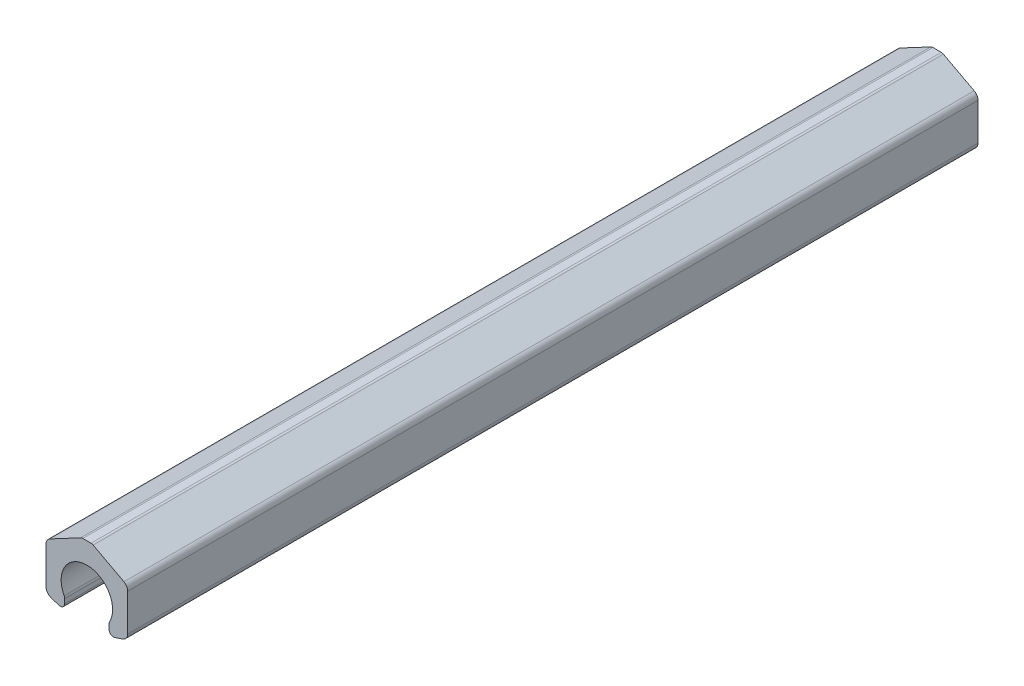
ISO-10303-21;
HEADER;
FILE_DESCRIPTION(('STEP AP214'),'2;1');
FILE_NAME('part.step','',(''),(''),'','','');
FILE_SCHEMA(('AUTOMOTIVE_DESIGN { 1 0 10303 214 1 1 1 1 }'));
ENDSEC;
DATA;
#1=APPLICATION_CONTEXT('core data for automotive mechanical design processes');
#2=APPLICATION_PROTOCOL_DEFINITION('international standard','automotive_design',2000,#1);
#3=PRODUCT_CONTEXT('',#1,'mechanical');
#4=PRODUCT('Part','Part','',(#3));
#5=PRODUCT_RELATED_PRODUCT_CATEGORY('part','',(#4));
#6=PRODUCT_DEFINITION_FORMATION('','',#4);
#7=PRODUCT_DEFINITION_CONTEXT('part definition',#1,'design');
#8=PRODUCT_DEFINITION('design','',#6,#7);
#9=PRODUCT_DEFINITION_SHAPE('','',#8);
#10=(LENGTH_UNIT() NAMED_UNIT(*) SI_UNIT(.MILLI.,.METRE.));
#11=(NAMED_UNIT(*) PLANE_ANGLE_UNIT() SI_UNIT($,.RADIAN.));
#12=(NAMED_UNIT(*) SI_UNIT($,.STERADIAN.) SOLID_ANGLE_UNIT());
#13=UNCERTAINTY_MEASURE_WITH_UNIT(LENGTH_MEASURE(1.E-05),#10,'distance_accuracy_value','');
#14=(GEOMETRIC_REPRESENTATION_CONTEXT(3) GLOBAL_UNCERTAINTY_ASSIGNED_CONTEXT((#13)) GLOBAL_UNIT_ASSIGNED_CONTEXT((#10,
#11,#12)) REPRESENTATION_CONTEXT('',''));
#15=CARTESIAN_POINT('',(0.,0.,0.));
#16=DIRECTION('',(0.,0.,1.));
#17=DIRECTION('',(1.,0.,0.));
#18=AXIS2_PLACEMENT_3D('',#15,#16,#17);
#19=CARTESIAN_POINT('',(2.9718,30.353,-609.6));
#20=DIRECTION('',(0.,0.,1.));
#21=DIRECTION('',(1.,0.,0.));
#22=AXIS2_PLACEMENT_3D('',#19,#20,#21);
#23=CYLINDRICAL_SURFACE('',#22,3.175);
#24=CARTESIAN_POINT('',(2.9718,30.353,0.));
#25=DIRECTION('',(0.,0.,1.));
#26=DIRECTION('',(1.,0.,0.));
#27=AXIS2_PLACEMENT_3D('',#24,#25,#26);
#28=CIRCLE('',#27,3.175);
#29=CARTESIAN_POINT('',(4.46106491990098,33.1570533158898,0.));
#30=VERTEX_POINT('',#29);
#31=CARTESIAN_POINT('',(2.9718,33.528,0.));
#32=VERTEX_POINT('',#31);
#33=EDGE_CURVE('E201',#30,#32,#28,.T.);
#34=ORIENTED_EDGE('',*,*,#33,.F.);
#35=DIRECTION('',(0.,0.,1.));
#36=VECTOR('',#35,1.);
#37=CARTESIAN_POINT('',(4.46106491990098,33.1570533158898,-609.6));
#38=LINE('',#37,#36);
#39=CARTESIAN_POINT('',(4.46106491990098,33.1570533158898,-609.6));
#40=VERTEX_POINT('',#39);
#41=EDGE_CURVE('E11',#40,#30,#38,.T.);
#42=ORIENTED_EDGE('',*,*,#41,.F.);
#43=CARTESIAN_POINT('',(2.9718,30.353,-609.6));
#44=DIRECTION('',(0.,0.,1.));
#45=DIRECTION('',(1.,0.,0.));
#46=AXIS2_PLACEMENT_3D('',#43,#44,#45);
#47=CIRCLE('',#46,3.175);
#48=CARTESIAN_POINT('',(2.9718,33.528,-609.6));
#49=VERTEX_POINT('',#48);
#50=EDGE_CURVE('E257',#40,#49,#47,.T.);
#51=ORIENTED_EDGE('',*,*,#50,.T.);
#52=DIRECTION('',(0.,0.,1.));
#53=VECTOR('',#52,1.);
#54=CARTESIAN_POINT('',(2.9718,33.528,-609.6));
#55=LINE('',#54,#53);
#56=EDGE_CURVE('E35',#49,#32,#55,.T.);
#57=ORIENTED_EDGE('',*,*,#56,.T.);
#58=EDGE_LOOP('',(#34,#42,#51,#57));
#59=FACE_BOUND('',#58,.T.);
#60=ADVANCED_FACE('F32',(#59),#23,.T.);
#61=CARTESIAN_POINT('',(26.5612662299192,21.419382585005,-609.6));
#62=DIRECTION('',(0.469059817291645,0.883166398705435,0.));
#63=DIRECTION('',(-0.883166398705436,0.469059817291645,0.));
#64=AXIS2_PLACEMENT_3D('',#61,#62,#63);
#65=PLANE('',#64);
#66=DIRECTION('',(-0.883166398705435,0.469059817291645,0.));
#67=VECTOR('',#66,1.);
#68=CARTESIAN_POINT('',(26.5612662299192,21.419382585005,0.));
#69=LINE('',#68,#67);
#70=CARTESIAN_POINT('',(26.5612662299192,21.419382585005,0.));
#71=VERTEX_POINT('',#70);
#72=EDGE_CURVE('E255',#71,#30,#69,.T.);
#73=ORIENTED_EDGE('',*,*,#72,.F.);
#74=DIRECTION('',(0.,0.,1.));
#75=VECTOR('',#74,1.);
#76=CARTESIAN_POINT('',(26.5612662299192,21.419382585005,-609.6));
#77=LINE('',#76,#75);
#78=CARTESIAN_POINT('',(26.5612662299192,21.419382585005,-609.6));
#79=VERTEX_POINT('',#78);
#80=EDGE_CURVE('E41',#79,#71,#77,.T.);
#81=ORIENTED_EDGE('',*,*,#80,.F.);
#82=DIRECTION('',(-0.883166398705435,0.469059817291645,0.));
#83=VECTOR('',#82,1.);
#84=CARTESIAN_POINT('',(26.5612662299192,21.419382585005,-609.6));
#85=LINE('',#84,#83);
#86=EDGE_CURVE('E191',#79,#40,#85,.T.);
#87=ORIENTED_EDGE('',*,*,#86,.T.);
#88=ORIENTED_EDGE('',*,*,#41,.T.);
#89=EDGE_LOOP('',(#73,#81,#87,#88));
#90=FACE_BOUND('',#89,.T.);
#91=ADVANCED_FACE('F293',(#90),#65,.T.);
#92=CARTESIAN_POINT('',(24.1427,16.8656,-609.6));
#93=DIRECTION('',(0.,0.,1.));
#94=DIRECTION('',(1.,0.,0.));
#95=AXIS2_PLACEMENT_3D('',#92,#93,#94);
#96=CYLINDRICAL_SURFACE('',#95,5.1562);
#97=CARTESIAN_POINT('',(24.1427,16.8656,0.));
#98=DIRECTION('',(0.,0.,1.));
#99=DIRECTION('',(1.,0.,0.));
#100=AXIS2_PLACEMENT_3D('',#97,#98,#99);
#101=CIRCLE('',#100,5.1562);
#102=CARTESIAN_POINT('',(29.2989,16.8656,0.));
#103=VERTEX_POINT('',#102);
#104=EDGE_CURVE('E178',#103,#71,#101,.T.);
#105=ORIENTED_EDGE('',*,*,#104,.F.);
#106=DIRECTION('',(0.,0.,1.));
#107=VECTOR('',#106,1.);
#108=CARTESIAN_POINT('',(29.2989,16.8656,-609.6));
#109=LINE('',#108,#107);
#110=CARTESIAN_POINT('',(29.2989,16.8656,-609.6));
#111=VERTEX_POINT('',#110);
#112=EDGE_CURVE('E173',#111,#103,#109,.T.);
#113=ORIENTED_EDGE('',*,*,#112,.F.);
#114=CARTESIAN_POINT('',(24.1427,16.8656,-609.6));
#115=DIRECTION('',(0.,0.,1.));
#116=DIRECTION('',(1.,0.,0.));
#117=AXIS2_PLACEMENT_3D('',#114,#115,#116);
#118=CIRCLE('',#117,5.1562);
#119=EDGE_CURVE('E176',#111,#79,#118,.T.);
#120=ORIENTED_EDGE('',*,*,#119,.T.);
#121=ORIENTED_EDGE('',*,*,#80,.T.);
#122=EDGE_LOOP('',(#105,#113,#120,#121));
#123=FACE_BOUND('',#122,.T.);
#124=ADVANCED_FACE('F175',(#123),#96,.T.);
#125=CARTESIAN_POINT('',(29.2989,-9.652,-609.6));
#126=DIRECTION('',(1.,0.,0.));
#127=DIRECTION('',(0.,1.,0.));
#128=AXIS2_PLACEMENT_3D('',#125,#126,#127);
#129=PLANE('',#128);
#130=DIRECTION('',(0.,1.,0.));
#131=VECTOR('',#130,1.);
#132=CARTESIAN_POINT('',(29.2989,-9.652,0.));
#133=LINE('',#132,#131);
#134=CARTESIAN_POINT('',(29.2989,-9.652,0.));
#135=VERTEX_POINT('',#134);
#136=EDGE_CURVE('E252',#135,#103,#133,.T.);
#137=ORIENTED_EDGE('',*,*,#136,.F.);
#138=DIRECTION('',(0.,0.,1.));
#139=VECTOR('',#138,1.);
#140=CARTESIAN_POINT('',(29.2989,-9.652,-609.6));
#141=LINE('',#140,#139);
#142=CARTESIAN_POINT('',(29.2989,-9.652,-609.6));
#143=VERTEX_POINT('',#142);
#144=EDGE_CURVE('E183',#143,#135,#141,.T.);
#145=ORIENTED_EDGE('',*,*,#144,.F.);
#146=DIRECTION('',(0.,1.,0.));
#147=VECTOR('',#146,1.);
#148=CARTESIAN_POINT('',(29.2989,-9.652,-609.6));
#149=LINE('',#148,#147);
#150=EDGE_CURVE('E189',#143,#111,#149,.T.);
#151=ORIENTED_EDGE('',*,*,#150,.T.);
#152=ORIENTED_EDGE('',*,*,#112,.T.);
#153=EDGE_LOOP('',(#137,#145,#151,#152));
#154=FACE_BOUND('',#153,.T.);
#155=ADVANCED_FACE('F193',(#154),#129,.T.);
#156=CARTESIAN_POINT('',(24.1427,-9.652,-609.6));
#157=DIRECTION('',(0.,0.,1.));
#158=DIRECTION('',(1.,0.,0.));
#159=AXIS2_PLACEMENT_3D('',#156,#157,#158);
#160=CYLINDRICAL_SURFACE('',#159,5.1562);
#161=CARTESIAN_POINT('',(24.1427,-9.652,0.));
#162=DIRECTION('',(0.,0.,1.));
#163=DIRECTION('',(1.,0.,0.));
#164=AXIS2_PLACEMENT_3D('',#161,#162,#163);
#165=CIRCLE('',#164,5.1562);
#166=CARTESIAN_POINT('',(25.9998307692308,-14.462141759447,0.));
#167=VERTEX_POINT('',#166);
#168=EDGE_CURVE('E249',#167,#135,#165,.T.);
#169=ORIENTED_EDGE('',*,*,#168,.F.);
#170=DIRECTION('',(0.,0.,1.));
#171=VECTOR('',#170,1.);
#172=CARTESIAN_POINT('',(25.9998307692308,-14.462141759447,-609.6));
#173=LINE('',#172,#171);
#174=CARTESIAN_POINT('',(25.9998307692308,-14.462141759447,-609.6));
#175=VERTEX_POINT('',#174);
#176=EDGE_CURVE('E261',#175,#167,#173,.T.);
#177=ORIENTED_EDGE('',*,*,#176,.F.);
#178=CARTESIAN_POINT('',(24.1427,-9.652,-609.6));
#179=DIRECTION('',(0.,0.,1.));
#180=DIRECTION('',(1.,0.,0.));
#181=AXIS2_PLACEMENT_3D('',#178,#179,#180);
#182=CIRCLE('',#181,5.1562);
#183=EDGE_CURVE('E194',#175,#143,#182,.T.);
#184=ORIENTED_EDGE('',*,*,#183,.T.);
#185=ORIENTED_EDGE('',*,*,#144,.T.);
#186=EDGE_LOOP('',(#169,#177,#184,#185));
#187=FACE_BOUND('',#186,.T.);
#188=ADVANCED_FACE('F306',(#187),#160,.T.);
#189=CARTESIAN_POINT('',(0.,52.8798428728116,-609.6));
#190=DIRECTION('',(0.,0.,1.));
#191=DIRECTION('',(1.,0.,0.));
#192=AXIS2_PLACEMENT_3D('',#189,#190,#191);
#193=CYLINDRICAL_SURFACE('',#192,72.1868);
#194=CARTESIAN_POINT('',(0.,52.8798428728116,0.));
#195=DIRECTION('',(0.,0.,1.));
#196=DIRECTION('',(1.,0.,0.));
#197=AXIS2_PLACEMENT_3D('',#194,#195,#196);
#198=CIRCLE('',#197,72.1868);
#199=CARTESIAN_POINT('',(19.9264262053735,-16.5022270943045,0.));
#200=VERTEX_POINT('',#199);
#201=EDGE_CURVE('E246',#200,#167,#198,.T.);
#202=ORIENTED_EDGE('',*,*,#201,.F.);
#203=DIRECTION('',(0.,0.,1.));
#204=VECTOR('',#203,1.);
#205=CARTESIAN_POINT('',(19.9264262053735,-16.5022270943045,-609.6));
#206=LINE('',#205,#204);
#207=CARTESIAN_POINT('',(19.9264262053735,-16.5022270943045,-609.6));
#208=VERTEX_POINT('',#207);
#209=EDGE_CURVE('E263',#208,#200,#206,.T.);
#210=ORIENTED_EDGE('',*,*,#209,.F.);
#211=CARTESIAN_POINT('',(0.,52.8798428728116,-609.6));
#212=DIRECTION('',(0.,0.,1.));
#213=DIRECTION('',(1.,0.,0.));
#214=AXIS2_PLACEMENT_3D('',#211,#212,#213);
#215=CIRCLE('',#214,72.1868);
#216=EDGE_CURVE('E196',#208,#175,#215,.T.);
#217=ORIENTED_EDGE('',*,*,#216,.T.);
#218=ORIENTED_EDGE('',*,*,#176,.T.);
#219=EDGE_LOOP('',(#202,#210,#217,#218));
#220=FACE_BOUND('',#219,.T.);
#221=ADVANCED_FACE('F309',(#220),#193,.T.);
#222=CARTESIAN_POINT('',(19.05,-13.4505878452231,-609.6));
#223=DIRECTION('',(0.,0.,1.));
#224=DIRECTION('',(1.,0.,0.));
#225=AXIS2_PLACEMENT_3D('',#222,#223,#224);
#226=CYLINDRICAL_SURFACE('',#225,3.175);
#227=CARTESIAN_POINT('',(19.05,-13.4505878452231,0.));
#228=DIRECTION('',(0.,0.,1.));
#229=DIRECTION('',(1.,0.,0.));
#230=AXIS2_PLACEMENT_3D('',#227,#228,#229);
#231=CIRCLE('',#230,3.175);
#232=CARTESIAN_POINT('',(15.875,-13.4505878452231,0.));
#233=VERTEX_POINT('',#232);
#234=EDGE_CURVE('E243',#233,#200,#231,.T.);
#235=ORIENTED_EDGE('',*,*,#234,.F.);
#236=DIRECTION('',(0.,0.,1.));
#237=VECTOR('',#236,1.);
#238=CARTESIAN_POINT('',(15.875,-13.4505878452231,-609.6));
#239=LINE('',#238,#237);
#240=CARTESIAN_POINT('',(15.875,-13.4505878452231,-609.6));
#241=VERTEX_POINT('',#240);
#242=EDGE_CURVE('E265',#241,#233,#239,.T.);
#243=ORIENTED_EDGE('',*,*,#242,.F.);
#244=CARTESIAN_POINT('',(19.05,-13.4505878452231,-609.6));
#245=DIRECTION('',(0.,0.,1.));
#246=DIRECTION('',(1.,0.,0.));
#247=AXIS2_PLACEMENT_3D('',#244,#245,#246);
#248=CIRCLE('',#247,3.175);
#249=EDGE_CURVE('E548',#241,#208,#248,.T.);
#250=ORIENTED_EDGE('',*,*,#249,.T.);
#251=ORIENTED_EDGE('',*,*,#209,.T.);
#252=EDGE_LOOP('',(#235,#243,#250,#251));
#253=FACE_BOUND('',#252,.T.);
#254=ADVANCED_FACE('F313',(#253),#226,.T.);
#255=CARTESIAN_POINT('',(15.875,-10.2407133350172,-609.6));
#256=DIRECTION('',(-1.,0.,0.));
#257=DIRECTION('',(0.,-1.,0.));
#258=AXIS2_PLACEMENT_3D('',#255,#256,#257);
#259=PLANE('',#258);
#260=DIRECTION('',(0.,-1.,0.));
#261=VECTOR('',#260,1.);
#262=CARTESIAN_POINT('',(15.875,-10.2407133350172,0.));
#263=LINE('',#262,#261);
#264=CARTESIAN_POINT('',(15.875,-10.2407133350172,0.));
#265=VERTEX_POINT('',#264);
#266=EDGE_CURVE('E240',#265,#233,#263,.T.);
#267=ORIENTED_EDGE('',*,*,#266,.F.);
#268=DIRECTION('',(0.,0.,1.));
#269=VECTOR('',#268,1.);
#270=CARTESIAN_POINT('',(15.875,-10.2407133350172,-609.6));
#271=LINE('',#270,#269);
#272=CARTESIAN_POINT('',(15.875,-10.2407133350172,-609.6));
#273=VERTEX_POINT('',#272);
#274=EDGE_CURVE('E267',#273,#265,#271,.T.);
#275=ORIENTED_EDGE('',*,*,#274,.F.);
#276=DIRECTION('',(0.,-1.,0.));
#277=VECTOR('',#276,1.);
#278=CARTESIAN_POINT('',(15.875,-10.2407133350172,-609.6));
#279=LINE('',#278,#277);
#280=EDGE_CURVE('E541',#273,#241,#279,.T.);
#281=ORIENTED_EDGE('',*,*,#280,.T.);
#282=ORIENTED_EDGE('',*,*,#242,.T.);
#283=EDGE_LOOP('',(#267,#275,#281,#282));
#284=FACE_BOUND('',#283,.T.);
#285=ADVANCED_FACE('F317',(#284),#259,.T.);
#286=CARTESIAN_POINT('',(19.05,-10.2407133350172,-609.6));
#287=DIRECTION('',(0.,0.,1.));
#288=DIRECTION('',(1.,0.,0.));
#289=AXIS2_PLACEMENT_3D('',#286,#287,#288);
#290=CYLINDRICAL_SURFACE('',#289,3.175);
#291=CARTESIAN_POINT('',(19.05,-10.2407133350172,0.));
#292=DIRECTION('',(0.,0.,1.));
#293=DIRECTION('',(1.,0.,0.));
#294=AXIS2_PLACEMENT_3D('',#291,#292,#293);
#295=CIRCLE('',#294,3.175);
#296=CARTESIAN_POINT('',(16.2534644744568,-8.73737902277162,0.));
#297=VERTEX_POINT('',#296);
#298=EDGE_CURVE('E237',#297,#265,#295,.T.);
#299=ORIENTED_EDGE('',*,*,#298,.F.);
#300=DIRECTION('',(0.,0.,1.));
#301=VECTOR('',#300,1.);
#302=CARTESIAN_POINT('',(16.2534644744568,-8.73737902277162,-609.6));
#303=LINE('',#302,#301);
#304=CARTESIAN_POINT('',(16.2534644744568,-8.73737902277162,-609.6));
#305=VERTEX_POINT('',#304);
#306=EDGE_CURVE('E269',#305,#297,#303,.T.);
#307=ORIENTED_EDGE('',*,*,#306,.F.);
#308=CARTESIAN_POINT('',(19.05,-10.2407133350172,-609.6));
#309=DIRECTION('',(0.,0.,1.));
#310=DIRECTION('',(1.,0.,0.));
#311=AXIS2_PLACEMENT_3D('',#308,#309,#310);
#312=CIRCLE('',#311,3.175);
#313=EDGE_CURVE('E537',#305,#273,#312,.T.);
#314=ORIENTED_EDGE('',*,*,#313,.T.);
#315=ORIENTED_EDGE('',*,*,#274,.T.);
#316=EDGE_LOOP('',(#299,#307,#314,#315));
#317=FACE_BOUND('',#316,.T.);
#318=ADVANCED_FACE('F321',(#317),#290,.T.);
#319=CARTESIAN_POINT('',(0.,0.,-609.6));
#320=DIRECTION('',(0.,0.,1.));
#321=DIRECTION('',(1.,0.,0.));
#322=AXIS2_PLACEMENT_3D('',#319,#320,#321);
#323=CYLINDRICAL_SURFACE('',#322,18.4531);
#324=CARTESIAN_POINT('',(0.,0.,0.));
#325=DIRECTION('',(0.,0.,-1.));
#326=DIRECTION('',(-1.,0.,0.));
#327=AXIS2_PLACEMENT_3D('',#324,#325,#326);
#328=CIRCLE('',#327,18.4531);
#329=CARTESIAN_POINT('',(-16.2534644744568,-8.73737902277161,0.));
#330=VERTEX_POINT('',#329);
#331=EDGE_CURVE('E234',#330,#297,#328,.T.);
#332=ORIENTED_EDGE('',*,*,#331,.F.);
#333=DIRECTION('',(0.,0.,1.));
#334=VECTOR('',#333,1.);
#335=CARTESIAN_POINT('',(-16.2534644744568,-8.73737902277161,-609.6));
#336=LINE('',#335,#334);
#337=CARTESIAN_POINT('',(-16.2534644744568,-8.73737902277161,-609.6));
#338=VERTEX_POINT('',#337);
#339=EDGE_CURVE('E271',#338,#330,#336,.T.);
#340=ORIENTED_EDGE('',*,*,#339,.F.);
#341=CARTESIAN_POINT('',(0.,0.,-609.6));
#342=DIRECTION('',(0.,0.,-1.));
#343=DIRECTION('',(-1.,0.,0.));
#344=AXIS2_PLACEMENT_3D('',#341,#342,#343);
#345=CIRCLE('',#344,18.4531);
#346=EDGE_CURVE('E553',#338,#305,#345,.T.);
#347=ORIENTED_EDGE('',*,*,#346,.T.);
#348=ORIENTED_EDGE('',*,*,#306,.T.);
#349=EDGE_LOOP('',(#332,#340,#347,#348));
#350=FACE_BOUND('',#349,.T.);
#351=ADVANCED_FACE('F325',(#350),#323,.F.);
#352=CARTESIAN_POINT('',(-19.05,-10.2407133350172,-609.6));
#353=DIRECTION('',(0.,0.,1.));
#354=DIRECTION('',(1.,0.,0.));
#355=AXIS2_PLACEMENT_3D('',#352,#353,#354);
#356=CYLINDRICAL_SURFACE('',#355,3.175);
#357=CARTESIAN_POINT('',(-19.05,-10.2407133350172,0.));
#358=DIRECTION('',(0.,0.,1.));
#359=DIRECTION('',(1.,0.,0.));
#360=AXIS2_PLACEMENT_3D('',#357,#358,#359);
#361=CIRCLE('',#360,3.175);
#362=CARTESIAN_POINT('',(-15.875,-10.2407133350172,0.));
#363=VERTEX_POINT('',#362);
#364=EDGE_CURVE('E231',#363,#330,#361,.T.);
#365=ORIENTED_EDGE('',*,*,#364,.F.);
#366=DIRECTION('',(0.,0.,1.));
#367=VECTOR('',#366,1.);
#368=CARTESIAN_POINT('',(-15.875,-10.2407133350172,-609.6));
#369=LINE('',#368,#367);
#370=CARTESIAN_POINT('',(-15.875,-10.2407133350172,-609.6));
#371=VERTEX_POINT('',#370);
#372=EDGE_CURVE('E273',#371,#363,#369,.T.);
#373=ORIENTED_EDGE('',*,*,#372,.F.);
#374=CARTESIAN_POINT('',(-19.05,-10.2407133350172,-609.6));
#375=DIRECTION('',(0.,0.,1.));
#376=DIRECTION('',(1.,0.,0.));
#377=AXIS2_PLACEMENT_3D('',#374,#375,#376);
#378=CIRCLE('',#377,3.175);
#379=EDGE_CURVE('E530',#371,#338,#378,.T.);
#380=ORIENTED_EDGE('',*,*,#379,.T.);
#381=ORIENTED_EDGE('',*,*,#339,.T.);
#382=EDGE_LOOP('',(#365,#373,#380,#381));
#383=FACE_BOUND('',#382,.T.);
#384=ADVANCED_FACE('F329',(#383),#356,.T.);
#385=CARTESIAN_POINT('',(-15.875,-13.4505878452231,-609.6));
#386=DIRECTION('',(1.,0.,0.));
#387=DIRECTION('',(0.,1.,0.));
#388=AXIS2_PLACEMENT_3D('',#385,#386,#387);
#389=PLANE('',#388);
#390=DIRECTION('',(0.,1.,0.));
#391=VECTOR('',#390,1.);
#392=CARTESIAN_POINT('',(-15.875,-13.4505878452231,0.));
#393=LINE('',#392,#391);
#394=CARTESIAN_POINT('',(-15.875,-13.4505878452231,0.));
#395=VERTEX_POINT('',#394);
#396=EDGE_CURVE('E228',#395,#363,#393,.T.);
#397=ORIENTED_EDGE('',*,*,#396,.F.);
#398=DIRECTION('',(0.,0.,1.));
#399=VECTOR('',#398,1.);
#400=CARTESIAN_POINT('',(-15.875,-13.4505878452231,-609.6));
#401=LINE('',#400,#399);
#402=CARTESIAN_POINT('',(-15.875,-13.4505878452231,-609.6));
#403=VERTEX_POINT('',#402);
#404=EDGE_CURVE('E275',#403,#395,#401,.T.);
#405=ORIENTED_EDGE('',*,*,#404,.F.);
#406=DIRECTION('',(0.,1.,0.));
#407=VECTOR('',#406,1.);
#408=CARTESIAN_POINT('',(-15.875,-13.4505878452231,-609.6));
#409=LINE('',#408,#407);
#410=EDGE_CURVE('E526',#403,#371,#409,.T.);
#411=ORIENTED_EDGE('',*,*,#410,.T.);
#412=ORIENTED_EDGE('',*,*,#372,.T.);
#413=EDGE_LOOP('',(#397,#405,#411,#412));
#414=FACE_BOUND('',#413,.T.);
#415=ADVANCED_FACE('F333',(#414),#389,.T.);
#416=CARTESIAN_POINT('',(-19.05,-13.4505878452231,-609.6));
#417=DIRECTION('',(0.,0.,1.));
#418=DIRECTION('',(1.,0.,0.));
#419=AXIS2_PLACEMENT_3D('',#416,#417,#418);
#420=CYLINDRICAL_SURFACE('',#419,3.175);
#421=CARTESIAN_POINT('',(-19.05,-13.4505878452231,0.));
#422=DIRECTION('',(0.,0.,1.));
#423=DIRECTION('',(1.,0.,0.));
#424=AXIS2_PLACEMENT_3D('',#421,#422,#423);
#425=CIRCLE('',#424,3.175);
#426=CARTESIAN_POINT('',(-19.9264262053736,-16.5022270943045,0.));
#427=VERTEX_POINT('',#426);
#428=EDGE_CURVE('E225',#427,#395,#425,.T.);
#429=ORIENTED_EDGE('',*,*,#428,.F.);
#430=DIRECTION('',(0.,0.,1.));
#431=VECTOR('',#430,1.);
#432=CARTESIAN_POINT('',(-19.9264262053736,-16.5022270943045,-609.6));
#433=LINE('',#432,#431);
#434=CARTESIAN_POINT('',(-19.9264262053736,-16.5022270943045,-609.6));
#435=VERTEX_POINT('',#434);
#436=EDGE_CURVE('E277',#435,#427,#433,.T.);
#437=ORIENTED_EDGE('',*,*,#436,.F.);
#438=CARTESIAN_POINT('',(-19.05,-13.4505878452231,-609.6));
#439=DIRECTION('',(0.,0.,1.));
#440=DIRECTION('',(1.,0.,0.));
#441=AXIS2_PLACEMENT_3D('',#438,#439,#440);
#442=CIRCLE('',#441,3.175);
#443=EDGE_CURVE('E557',#435,#403,#442,.T.);
#444=ORIENTED_EDGE('',*,*,#443,.T.);
#445=ORIENTED_EDGE('',*,*,#404,.T.);
#446=EDGE_LOOP('',(#429,#437,#444,#445));
#447=FACE_BOUND('',#446,.T.);
#448=ADVANCED_FACE('F337',(#447),#420,.T.);
#449=CARTESIAN_POINT('',(0.,52.8798428728116,-609.6));
#450=DIRECTION('',(0.,0.,1.));
#451=DIRECTION('',(1.,0.,0.));
#452=AXIS2_PLACEMENT_3D('',#449,#450,#451);
#453=CYLINDRICAL_SURFACE('',#452,72.1868);
#454=CARTESIAN_POINT('',(0.,52.8798428728116,0.));
#455=DIRECTION('',(0.,0.,1.));
#456=DIRECTION('',(1.,0.,0.));
#457=AXIS2_PLACEMENT_3D('',#454,#455,#456);
#458=CIRCLE('',#457,72.1868);
#459=CARTESIAN_POINT('',(-25.9998307692308,-14.4621417594471,0.));
#460=VERTEX_POINT('',#459);
#461=EDGE_CURVE('E222',#460,#427,#458,.T.);
#462=ORIENTED_EDGE('',*,*,#461,.F.);
#463=DIRECTION('',(0.,0.,1.));
#464=VECTOR('',#463,1.);
#465=CARTESIAN_POINT('',(-25.9998307692308,-14.4621417594471,-609.6));
#466=LINE('',#465,#464);
#467=CARTESIAN_POINT('',(-25.9998307692308,-14.4621417594471,-609.6));
#468=VERTEX_POINT('',#467);
#469=EDGE_CURVE('E279',#468,#460,#466,.T.);
#470=ORIENTED_EDGE('',*,*,#469,.F.);
#471=CARTESIAN_POINT('',(0.,52.8798428728116,-609.6));
#472=DIRECTION('',(0.,0.,1.));
#473=DIRECTION('',(1.,0.,0.));
#474=AXIS2_PLACEMENT_3D('',#471,#472,#473);
#475=CIRCLE('',#474,72.1868);
#476=EDGE_CURVE('E519',#468,#435,#475,.T.);
#477=ORIENTED_EDGE('',*,*,#476,.T.);
#478=ORIENTED_EDGE('',*,*,#436,.T.);
#479=EDGE_LOOP('',(#462,#470,#477,#478));
#480=FACE_BOUND('',#479,.T.);
#481=ADVANCED_FACE('F341',(#480),#453,.T.);
#482=CARTESIAN_POINT('',(-24.1427,-9.652,-609.6));
#483=DIRECTION('',(0.,0.,1.));
#484=DIRECTION('',(1.,0.,0.));
#485=AXIS2_PLACEMENT_3D('',#482,#483,#484);
#486=CYLINDRICAL_SURFACE('',#485,5.1562);
#487=CARTESIAN_POINT('',(-24.1427,-9.652,0.));
#488=DIRECTION('',(0.,0.,1.));
#489=DIRECTION('',(1.,0.,0.));
#490=AXIS2_PLACEMENT_3D('',#487,#488,#489);
#491=CIRCLE('',#490,5.1562);
#492=CARTESIAN_POINT('',(-29.2989,-9.652,0.));
#493=VERTEX_POINT('',#492);
#494=EDGE_CURVE('E219',#493,#460,#491,.T.);
#495=ORIENTED_EDGE('',*,*,#494,.F.);
#496=DIRECTION('',(0.,0.,1.));
#497=VECTOR('',#496,1.);
#498=CARTESIAN_POINT('',(-29.2989,-9.652,-609.6));
#499=LINE('',#498,#497);
#500=CARTESIAN_POINT('',(-29.2989,-9.652,-609.6));
#501=VERTEX_POINT('',#500);
#502=EDGE_CURVE('E281',#501,#493,#499,.T.);
#503=ORIENTED_EDGE('',*,*,#502,.F.);
#504=CARTESIAN_POINT('',(-24.1427,-9.652,-609.6));
#505=DIRECTION('',(0.,0.,1.));
#506=DIRECTION('',(1.,0.,0.));
#507=AXIS2_PLACEMENT_3D('',#504,#505,#506);
#508=CIRCLE('',#507,5.1562);
#509=EDGE_CURVE('E515',#501,#468,#508,.T.);
#510=ORIENTED_EDGE('',*,*,#509,.T.);
#511=ORIENTED_EDGE('',*,*,#469,.T.);
#512=EDGE_LOOP('',(#495,#503,#510,#511));
#513=FACE_BOUND('',#512,.T.);
#514=ADVANCED_FACE('F345',(#513),#486,.T.);
#515=CARTESIAN_POINT('',(-29.2989,16.8656,-609.6));
#516=DIRECTION('',(-1.,0.,0.));
#517=DIRECTION('',(0.,0.,1.));
#518=AXIS2_PLACEMENT_3D('',#515,#516,#517);
#519=PLANE('',#518);
#520=DIRECTION('',(0.,-1.,0.));
#521=VECTOR('',#520,1.);
#522=CARTESIAN_POINT('',(-29.2989,16.8656,0.));
#523=LINE('',#522,#521);
#524=CARTESIAN_POINT('',(-29.2989,16.8656,0.));
#525=VERTEX_POINT('',#524);
#526=EDGE_CURVE('E216',#525,#493,#523,.T.);
#527=ORIENTED_EDGE('',*,*,#526,.F.);
#528=DIRECTION('',(0.,0.,1.));
#529=VECTOR('',#528,1.);
#530=CARTESIAN_POINT('',(-29.2989,16.8656,-609.6));
#531=LINE('',#530,#529);
#532=CARTESIAN_POINT('',(-29.2989,16.8656,-609.6));
#533=VERTEX_POINT('',#532);
#534=EDGE_CURVE('E283',#533,#525,#531,.T.);
#535=ORIENTED_EDGE('',*,*,#534,.F.);
#536=DIRECTION('',(0.,-1.,0.));
#537=VECTOR('',#536,1.);
#538=CARTESIAN_POINT('',(-29.2989,16.8656,-609.6));
#539=LINE('',#538,#537);
#540=EDGE_CURVE('E561',#533,#501,#539,.T.);
#541=ORIENTED_EDGE('',*,*,#540,.T.);
#542=ORIENTED_EDGE('',*,*,#502,.T.);
#543=EDGE_LOOP('',(#527,#535,#541,#542));
#544=FACE_BOUND('',#543,.T.);
#545=ADVANCED_FACE('F349',(#544),#519,.T.);
#546=CARTESIAN_POINT('',(-24.1427,16.8656,-609.6));
#547=DIRECTION('',(0.,0.,1.));
#548=DIRECTION('',(1.,0.,0.));
#549=AXIS2_PLACEMENT_3D('',#546,#547,#548);
#550=CYLINDRICAL_SURFACE('',#549,5.1562);
#551=CARTESIAN_POINT('',(-24.1427,16.8656,0.));
#552=DIRECTION('',(0.,0.,1.));
#553=DIRECTION('',(1.,0.,0.));
#554=AXIS2_PLACEMENT_3D('',#551,#552,#553);
#555=CIRCLE('',#554,5.1562);
#556=CARTESIAN_POINT('',(-26.5612662299192,21.419382585005,0.));
#557=VERTEX_POINT('',#556);
#558=EDGE_CURVE('E213',#557,#525,#555,.T.);
#559=ORIENTED_EDGE('',*,*,#558,.F.);
#560=DIRECTION('',(0.,0.,1.));
#561=VECTOR('',#560,1.);
#562=CARTESIAN_POINT('',(-26.5612662299192,21.419382585005,-609.6));
#563=LINE('',#562,#561);
#564=CARTESIAN_POINT('',(-26.5612662299192,21.419382585005,-609.6));
#565=VERTEX_POINT('',#564);
#566=EDGE_CURVE('E285',#565,#557,#563,.T.);
#567=ORIENTED_EDGE('',*,*,#566,.F.);
#568=CARTESIAN_POINT('',(-24.1427,16.8656,-609.6));
#569=DIRECTION('',(0.,0.,1.));
#570=DIRECTION('',(1.,0.,0.));
#571=AXIS2_PLACEMENT_3D('',#568,#569,#570);
#572=CIRCLE('',#571,5.1562);
#573=EDGE_CURVE('E508',#565,#533,#572,.T.);
#574=ORIENTED_EDGE('',*,*,#573,.T.);
#575=ORIENTED_EDGE('',*,*,#534,.T.);
#576=EDGE_LOOP('',(#559,#567,#574,#575));
#577=FACE_BOUND('',#576,.T.);
#578=ADVANCED_FACE('F353',(#577),#550,.T.);
#579=CARTESIAN_POINT('',(-4.46106491990098,33.1570533158898,-609.6));
#580=DIRECTION('',(-0.469059817291645,0.883166398705435,0.));
#581=DIRECTION('',(-0.883166398705436,-0.469059817291645,0.));
#582=AXIS2_PLACEMENT_3D('',#579,#580,#581);
#583=PLANE('',#582);
#584=DIRECTION('',(-0.883166398705436,-0.469059817291645,0.));
#585=VECTOR('',#584,1.);
#586=CARTESIAN_POINT('',(-4.46106491990098,33.1570533158898,0.));
#587=LINE('',#586,#585);
#588=CARTESIAN_POINT('',(-4.46106491990098,33.1570533158898,0.));
#589=VERTEX_POINT('',#588);
#590=EDGE_CURVE('E210',#589,#557,#587,.T.);
#591=ORIENTED_EDGE('',*,*,#590,.F.);
#592=DIRECTION('',(0.,0.,1.));
#593=VECTOR('',#592,1.);
#594=CARTESIAN_POINT('',(-4.46106491990098,33.1570533158898,-609.6));
#595=LINE('',#594,#593);
#596=CARTESIAN_POINT('',(-4.46106491990098,33.1570533158898,-609.6));
#597=VERTEX_POINT('',#596);
#598=EDGE_CURVE('E287',#597,#589,#595,.T.);
#599=ORIENTED_EDGE('',*,*,#598,.F.);
#600=DIRECTION('',(-0.883166398705436,-0.469059817291645,0.));
#601=VECTOR('',#600,1.);
#602=CARTESIAN_POINT('',(-4.46106491990098,33.1570533158898,-609.6));
#603=LINE('',#602,#601);
#604=EDGE_CURVE('E504',#597,#565,#603,.T.);
#605=ORIENTED_EDGE('',*,*,#604,.T.);
#606=ORIENTED_EDGE('',*,*,#566,.T.);
#607=EDGE_LOOP('',(#591,#599,#605,#606));
#608=FACE_BOUND('',#607,.T.);
#609=ADVANCED_FACE('F357',(#608),#583,.T.);
#610=CARTESIAN_POINT('',(-2.9718,30.353,-609.6));
#611=DIRECTION('',(0.,0.,1.));
#612=DIRECTION('',(1.,0.,0.));
#613=AXIS2_PLACEMENT_3D('',#610,#611,#612);
#614=CYLINDRICAL_SURFACE('',#613,3.175);
#615=CARTESIAN_POINT('',(-2.9718,30.353,0.));
#616=DIRECTION('',(0.,0.,1.));
#617=DIRECTION('',(1.,0.,0.));
#618=AXIS2_PLACEMENT_3D('',#615,#616,#617);
#619=CIRCLE('',#618,3.175);
#620=CARTESIAN_POINT('',(-2.9718,33.528,0.));
#621=VERTEX_POINT('',#620);
#622=EDGE_CURVE('E207',#621,#589,#619,.T.);
#623=ORIENTED_EDGE('',*,*,#622,.F.);
#624=DIRECTION('',(0.,0.,1.));
#625=VECTOR('',#624,1.);
#626=CARTESIAN_POINT('',(-2.9718,33.528,-609.6));
#627=LINE('',#626,#625);
#628=CARTESIAN_POINT('',(-2.9718,33.528,-609.6));
#629=VERTEX_POINT('',#628);
#630=EDGE_CURVE('E288',#629,#621,#627,.T.);
#631=ORIENTED_EDGE('',*,*,#630,.F.);
#632=CARTESIAN_POINT('',(-2.9718,30.353,-609.6));
#633=DIRECTION('',(0.,0.,1.));
#634=DIRECTION('',(1.,0.,0.));
#635=AXIS2_PLACEMENT_3D('',#632,#633,#634);
#636=CIRCLE('',#635,3.175);
#637=EDGE_CURVE('E565',#629,#597,#636,.T.);
#638=ORIENTED_EDGE('',*,*,#637,.T.);
#639=ORIENTED_EDGE('',*,*,#598,.T.);
#640=EDGE_LOOP('',(#623,#631,#638,#639));
#641=FACE_BOUND('',#640,.T.);
#642=ADVANCED_FACE('F361',(#641),#614,.T.);
#643=CARTESIAN_POINT('',(2.9718,33.528,-609.6));
#644=DIRECTION('',(0.,1.,0.));
#645=DIRECTION('',(0.,0.,1.));
#646=AXIS2_PLACEMENT_3D('',#643,#644,#645);
#647=PLANE('',#646);
#648=DIRECTION('',(-1.,0.,0.));
#649=VECTOR('',#648,1.);
#650=CARTESIAN_POINT('',(2.9718,33.528,0.));
#651=LINE('',#650,#649);
#652=EDGE_CURVE('E204',#32,#621,#651,.T.);
#653=ORIENTED_EDGE('',*,*,#652,.F.);
#654=ORIENTED_EDGE('',*,*,#56,.F.);
#655=DIRECTION('',(-1.,0.,0.));
#656=VECTOR('',#655,1.);
#657=CARTESIAN_POINT('',(2.9718,33.528,-609.6));
#658=LINE('',#657,#656);
#659=EDGE_CURVE('E567',#49,#629,#658,.T.);
#660=ORIENTED_EDGE('',*,*,#659,.T.);
#661=ORIENTED_EDGE('',*,*,#630,.T.);
#662=EDGE_LOOP('',(#653,#654,#660,#661));
#663=FACE_BOUND('',#662,.T.);
#664=ADVANCED_FACE('F290',(#663),#647,.T.);
#665=CARTESIAN_POINT('',(2.9718,30.353,-609.6));
#666=DIRECTION('',(0.,0.,1.));
#667=DIRECTION('',(1.,0.,0.));
#668=AXIS2_PLACEMENT_3D('',#665,#666,#667);
#669=PLANE('',#668);
#670=ORIENTED_EDGE('',*,*,#50,.F.);
#671=ORIENTED_EDGE('',*,*,#86,.F.);
#672=ORIENTED_EDGE('',*,*,#119,.F.);
#673=ORIENTED_EDGE('',*,*,#150,.F.);
#674=ORIENTED_EDGE('',*,*,#183,.F.);
#675=ORIENTED_EDGE('',*,*,#216,.F.);
#676=ORIENTED_EDGE('',*,*,#249,.F.);
#677=ORIENTED_EDGE('',*,*,#280,.F.);
#678=ORIENTED_EDGE('',*,*,#313,.F.);
#679=ORIENTED_EDGE('',*,*,#346,.F.);
#680=ORIENTED_EDGE('',*,*,#379,.F.);
#681=ORIENTED_EDGE('',*,*,#410,.F.);
#682=ORIENTED_EDGE('',*,*,#443,.F.);
#683=ORIENTED_EDGE('',*,*,#476,.F.);
#684=ORIENTED_EDGE('',*,*,#509,.F.);
#685=ORIENTED_EDGE('',*,*,#540,.F.);
#686=ORIENTED_EDGE('',*,*,#573,.F.);
#687=ORIENTED_EDGE('',*,*,#604,.F.);
#688=ORIENTED_EDGE('',*,*,#637,.F.);
#689=ORIENTED_EDGE('',*,*,#659,.F.);
#690=EDGE_LOOP('',(#670,#671,#672,#673,#674,#675,#676,#677,#678,#679,#680,#681,#682,#683,#684,
#685,#686,#687,#688,#689));
#691=FACE_BOUND('',#690,.T.);
#692=ADVANCED_FACE('F187',(#691),#669,.F.);
#693=CARTESIAN_POINT('',(2.9718,30.353,0.));
#694=DIRECTION('',(0.,0.,1.));
#695=DIRECTION('',(1.,0.,0.));
#696=AXIS2_PLACEMENT_3D('',#693,#694,#695);
#697=PLANE('',#696);
#698=ORIENTED_EDGE('',*,*,#33,.T.);
#699=ORIENTED_EDGE('',*,*,#652,.T.);
#700=ORIENTED_EDGE('',*,*,#622,.T.);
#701=ORIENTED_EDGE('',*,*,#590,.T.);
#702=ORIENTED_EDGE('',*,*,#558,.T.);
#703=ORIENTED_EDGE('',*,*,#526,.T.);
#704=ORIENTED_EDGE('',*,*,#494,.T.);
#705=ORIENTED_EDGE('',*,*,#461,.T.);
#706=ORIENTED_EDGE('',*,*,#428,.T.);
#707=ORIENTED_EDGE('',*,*,#396,.T.);
#708=ORIENTED_EDGE('',*,*,#364,.T.);
#709=ORIENTED_EDGE('',*,*,#331,.T.);
#710=ORIENTED_EDGE('',*,*,#298,.T.);
#711=ORIENTED_EDGE('',*,*,#266,.T.);
#712=ORIENTED_EDGE('',*,*,#234,.T.);
#713=ORIENTED_EDGE('',*,*,#201,.T.);
#714=ORIENTED_EDGE('',*,*,#168,.T.);
#715=ORIENTED_EDGE('',*,*,#136,.T.);
#716=ORIENTED_EDGE('',*,*,#104,.T.);
#717=ORIENTED_EDGE('',*,*,#72,.T.);
#718=EDGE_LOOP('',(#698,#699,#700,#701,#702,#703,#704,#705,#706,#707,#708,#709,#710,#711,#712,
#713,#714,#715,#716,#717));
#719=FACE_BOUND('',#718,.T.);
#720=ADVANCED_FACE('F292',(#719),#697,.T.);
#721=CLOSED_SHELL('',(#60,#91,#124,#155,#188,#221,#254,#285,#318,#351,#384,#415,#448,#481,#514,
#545,#578,#609,#642,#664,#692,#720));
#722=MANIFOLD_SOLID_BREP('B2',#721);
#723=ADVANCED_BREP_SHAPE_REPRESENTATION('',(#18,#722),#14);
#724=SHAPE_DEFINITION_REPRESENTATION(#9,#723);
ENDSEC;
END-ISO-10303-21;
